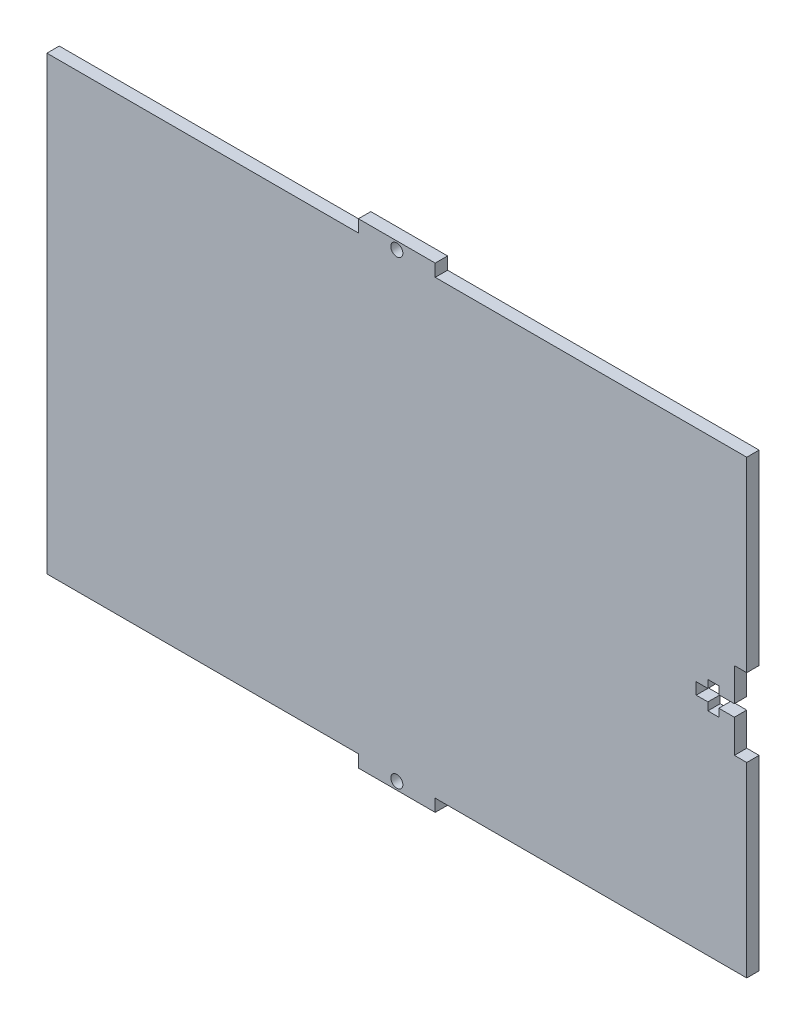
ISO-10303-21;
HEADER;
FILE_DESCRIPTION(('STEP AP214'),'2;1');
FILE_NAME('part.step','',(''),(''),'','','');
FILE_SCHEMA(('AUTOMOTIVE_DESIGN { 1 0 10303 214 1 1 1 1 }'));
ENDSEC;
DATA;
#1=APPLICATION_CONTEXT('core data for automotive mechanical design processes');
#2=APPLICATION_PROTOCOL_DEFINITION('international standard','automotive_design',2000,#1);
#3=PRODUCT_CONTEXT('',#1,'mechanical');
#4=PRODUCT('Part','Part','',(#3));
#5=PRODUCT_RELATED_PRODUCT_CATEGORY('part','',(#4));
#6=PRODUCT_DEFINITION_FORMATION('','',#4);
#7=PRODUCT_DEFINITION_CONTEXT('part definition',#1,'design');
#8=PRODUCT_DEFINITION('design','',#6,#7);
#9=PRODUCT_DEFINITION_SHAPE('','',#8);
#10=(LENGTH_UNIT() NAMED_UNIT(*) SI_UNIT(.MILLI.,.METRE.));
#11=(NAMED_UNIT(*) PLANE_ANGLE_UNIT() SI_UNIT($,.RADIAN.));
#12=(NAMED_UNIT(*) SI_UNIT($,.STERADIAN.) SOLID_ANGLE_UNIT());
#13=UNCERTAINTY_MEASURE_WITH_UNIT(LENGTH_MEASURE(1.E-05),#10,'distance_accuracy_value','');
#14=(GEOMETRIC_REPRESENTATION_CONTEXT(3) GLOBAL_UNCERTAINTY_ASSIGNED_CONTEXT((#13)) GLOBAL_UNIT_ASSIGNED_CONTEXT((#10,
#11,#12)) REPRESENTATION_CONTEXT('',''));
#15=CARTESIAN_POINT('',(0.,0.,0.));
#16=DIRECTION('',(0.,0.,1.));
#17=DIRECTION('',(1.,0.,0.));
#18=AXIS2_PLACEMENT_3D('',#15,#16,#17);
#19=CARTESIAN_POINT('',(-90.,61.18,3.18));
#20=DIRECTION('',(1.,0.,0.));
#21=DIRECTION('',(0.,1.,0.));
#22=AXIS2_PLACEMENT_3D('',#19,#20,#21);
#23=PLANE('',#22);
#24=DIRECTION('',(0.,0.,1.));
#25=VECTOR('',#24,1.);
#26=CARTESIAN_POINT('',(-90.,58.,0.));
#27=LINE('',#26,#25);
#28=CARTESIAN_POINT('',(-90.,58.,0.));
#29=VERTEX_POINT('',#28);
#30=CARTESIAN_POINT('',(-90.,58.,3.18));
#31=VERTEX_POINT('',#30);
#32=EDGE_CURVE('E224',#29,#31,#27,.T.);
#33=ORIENTED_EDGE('',*,*,#32,.F.);
#34=DIRECTION('',(0.,-1.,0.));
#35=VECTOR('',#34,1.);
#36=CARTESIAN_POINT('',(-90.,61.18,0.));
#37=LINE('',#36,#35);
#38=CARTESIAN_POINT('',(-90.,-58.,0.));
#39=VERTEX_POINT('',#38);
#40=EDGE_CURVE('E235',#29,#39,#37,.T.);
#41=ORIENTED_EDGE('',*,*,#40,.T.);
#42=DIRECTION('',(0.,0.,1.));
#43=VECTOR('',#42,1.);
#44=CARTESIAN_POINT('',(-90.,-58.,0.));
#45=LINE('',#44,#43);
#46=CARTESIAN_POINT('',(-90.,-58.,3.18));
#47=VERTEX_POINT('',#46);
#48=EDGE_CURVE('E304',#39,#47,#45,.T.);
#49=ORIENTED_EDGE('',*,*,#48,.T.);
#50=DIRECTION('',(0.,-1.,0.));
#51=VECTOR('',#50,1.);
#52=CARTESIAN_POINT('',(-90.,61.18,3.18));
#53=LINE('',#52,#51);
#54=EDGE_CURVE('E237',#31,#47,#53,.T.);
#55=ORIENTED_EDGE('',*,*,#54,.F.);
#56=EDGE_LOOP('',(#33,#41,#49,#55));
#57=FACE_BOUND('',#56,.T.);
#58=ADVANCED_FACE('F37',(#57),#23,.F.);
#59=CARTESIAN_POINT('',(90.,61.18,3.18));
#60=DIRECTION('',(-1.,0.,0.));
#61=DIRECTION('',(0.,-1.,0.));
#62=AXIS2_PLACEMENT_3D('',#59,#60,#61);
#63=PLANE('',#62);
#64=DIRECTION('',(0.,0.,1.));
#65=VECTOR('',#64,1.);
#66=CARTESIAN_POINT('',(90.,58.,0.));
#67=LINE('',#66,#65);
#68=CARTESIAN_POINT('',(90.,58.,0.));
#69=VERTEX_POINT('',#68);
#70=CARTESIAN_POINT('',(90.,58.,3.18));
#71=VERTEX_POINT('',#70);
#72=EDGE_CURVE('E230',#69,#71,#67,.T.);
#73=ORIENTED_EDGE('',*,*,#72,.T.);
#74=DIRECTION('',(0.,1.,0.));
#75=VECTOR('',#74,1.);
#76=CARTESIAN_POINT('',(90.,61.18,3.18));
#77=LINE('',#76,#75);
#78=CARTESIAN_POINT('',(90.,10.,3.18));
#79=VERTEX_POINT('',#78);
#80=EDGE_CURVE('E448',#79,#71,#77,.T.);
#81=ORIENTED_EDGE('',*,*,#80,.F.);
#82=DIRECTION('',(0.,0.,1.));
#83=VECTOR('',#82,1.);
#84=CARTESIAN_POINT('',(90.,10.,0.));
#85=LINE('',#84,#83);
#86=CARTESIAN_POINT('',(90.,10.,0.));
#87=VERTEX_POINT('',#86);
#88=EDGE_CURVE('E268',#87,#79,#85,.T.);
#89=ORIENTED_EDGE('',*,*,#88,.F.);
#90=DIRECTION('',(0.,1.,0.));
#91=VECTOR('',#90,1.);
#92=CARTESIAN_POINT('',(90.,61.18,0.));
#93=LINE('',#92,#91);
#94=EDGE_CURVE('E247',#87,#69,#93,.T.);
#95=ORIENTED_EDGE('',*,*,#94,.T.);
#96=EDGE_LOOP('',(#73,#81,#89,#95));
#97=FACE_BOUND('',#96,.T.);
#98=ADVANCED_FACE('F265',(#97),#63,.F.);
#99=CARTESIAN_POINT('',(-90.,61.18,3.18));
#100=DIRECTION('',(0.,-1.,0.));
#101=DIRECTION('',(0.,0.,-1.));
#102=AXIS2_PLACEMENT_3D('',#99,#100,#101);
#103=PLANE('',#102);
#104=DIRECTION('',(0.,0.,1.));
#105=VECTOR('',#104,1.);
#106=CARTESIAN_POINT('',(-9.87499999999999,61.18,0.));
#107=LINE('',#106,#105);
#108=CARTESIAN_POINT('',(-9.87499999999999,61.18,0.));
#109=VERTEX_POINT('',#108);
#110=CARTESIAN_POINT('',(-9.87499999999999,61.18,3.18));
#111=VERTEX_POINT('',#110);
#112=EDGE_CURVE('E290',#109,#111,#107,.T.);
#113=ORIENTED_EDGE('',*,*,#112,.T.);
#114=DIRECTION('',(-1.,0.,0.));
#115=VECTOR('',#114,1.);
#116=CARTESIAN_POINT('',(-90.,61.18,3.18));
#117=LINE('',#116,#115);
#118=CARTESIAN_POINT('',(9.87500000000001,61.18,3.18));
#119=VERTEX_POINT('',#118);
#120=EDGE_CURVE('E11',#119,#111,#117,.T.);
#121=ORIENTED_EDGE('',*,*,#120,.F.);
#122=DIRECTION('',(0.,0.,1.));
#123=VECTOR('',#122,1.);
#124=CARTESIAN_POINT('',(9.87500000000001,61.18,0.));
#125=LINE('',#124,#123);
#126=CARTESIAN_POINT('',(9.87500000000001,61.18,0.));
#127=VERTEX_POINT('',#126);
#128=EDGE_CURVE('E278',#127,#119,#125,.T.);
#129=ORIENTED_EDGE('',*,*,#128,.F.);
#130=DIRECTION('',(-1.,0.,0.));
#131=VECTOR('',#130,1.);
#132=CARTESIAN_POINT('',(-90.,61.18,0.));
#133=LINE('',#132,#131);
#134=EDGE_CURVE('E40',#127,#109,#133,.T.);
#135=ORIENTED_EDGE('',*,*,#134,.T.);
#136=EDGE_LOOP('',(#113,#121,#129,#135));
#137=FACE_BOUND('',#136,.T.);
#138=ADVANCED_FACE('F573',(#137),#103,.F.);
#139=CARTESIAN_POINT('',(0.,0.,3.18));
#140=DIRECTION('',(0.,0.,1.));
#141=DIRECTION('',(1.,0.,0.));
#142=AXIS2_PLACEMENT_3D('',#139,#140,#141);
#143=PLANE('',#142);
#144=CARTESIAN_POINT('',(0.,59.18,3.18));
#145=DIRECTION('',(0.,0.,1.));
#146=DIRECTION('',(1.,0.,0.));
#147=AXIS2_PLACEMENT_3D('',#144,#145,#146);
#148=CIRCLE('',#147,1.55);
#149=CARTESIAN_POINT('',(1.55000000000001,59.18,3.18));
#150=VERTEX_POINT('',#149);
#151=EDGE_CURVE('E543',#150,#150,#148,.F.);
#152=ORIENTED_EDGE('',*,*,#151,.T.);
#153=EDGE_LOOP('',(#152));
#154=FACE_BOUND('',#153,.T.);
#155=CARTESIAN_POINT('',(0.,-59.18,3.18));
#156=DIRECTION('',(0.,0.,1.));
#157=DIRECTION('',(1.,0.,0.));
#158=AXIS2_PLACEMENT_3D('',#155,#156,#157);
#159=CIRCLE('',#158,1.55);
#160=CARTESIAN_POINT('',(1.55000000000001,-59.18,3.18));
#161=VERTEX_POINT('',#160);
#162=EDGE_CURVE('E281',#161,#161,#159,.T.);
#163=ORIENTED_EDGE('',*,*,#162,.F.);
#164=EDGE_LOOP('',(#163));
#165=FACE_BOUND('',#164,.T.);
#166=ORIENTED_EDGE('',*,*,#120,.T.);
#167=DIRECTION('',(0.,-1.,0.));
#168=VECTOR('',#167,1.);
#169=CARTESIAN_POINT('',(-9.87499999999999,0.,3.18));
#170=LINE('',#169,#168);
#171=CARTESIAN_POINT('',(-9.87499999999999,58.,3.18));
#172=VERTEX_POINT('',#171);
#173=EDGE_CURVE('E295',#111,#172,#170,.T.);
#174=ORIENTED_EDGE('',*,*,#173,.T.);
#175=DIRECTION('',(-1.,0.,0.));
#176=VECTOR('',#175,1.);
#177=CARTESIAN_POINT('',(0.,58.,3.18));
#178=LINE('',#177,#176);
#179=EDGE_CURVE('E293',#172,#31,#178,.T.);
#180=ORIENTED_EDGE('',*,*,#179,.T.);
#181=ORIENTED_EDGE('',*,*,#54,.T.);
#182=DIRECTION('',(-1.,0.,0.));
#183=VECTOR('',#182,1.);
#184=CARTESIAN_POINT('',(0.,-58.,3.18));
#185=LINE('',#184,#183);
#186=CARTESIAN_POINT('',(-9.87499999999999,-58.,3.18));
#187=VERTEX_POINT('',#186);
#188=EDGE_CURVE('E328',#187,#47,#185,.T.);
#189=ORIENTED_EDGE('',*,*,#188,.F.);
#190=DIRECTION('',(0.,1.,0.));
#191=VECTOR('',#190,1.);
#192=CARTESIAN_POINT('',(-9.87499999999999,0.,3.18));
#193=LINE('',#192,#191);
#194=CARTESIAN_POINT('',(-9.87499999999999,-61.18,3.18));
#195=VERTEX_POINT('',#194);
#196=EDGE_CURVE('E326',#195,#187,#193,.T.);
#197=ORIENTED_EDGE('',*,*,#196,.F.);
#198=DIRECTION('',(1.,0.,0.));
#199=VECTOR('',#198,1.);
#200=CARTESIAN_POINT('',(-90.,-61.18,3.18));
#201=LINE('',#200,#199);
#202=CARTESIAN_POINT('',(9.87500000000001,-61.18,3.18));
#203=VERTEX_POINT('',#202);
#204=EDGE_CURVE('E446',#195,#203,#201,.T.);
#205=ORIENTED_EDGE('',*,*,#204,.T.);
#206=DIRECTION('',(0.,-1.,0.));
#207=VECTOR('',#206,1.);
#208=CARTESIAN_POINT('',(9.87500000000001,0.,3.18));
#209=LINE('',#208,#207);
#210=CARTESIAN_POINT('',(9.87500000000001,-58.,3.18));
#211=VERTEX_POINT('',#210);
#212=EDGE_CURVE('E324',#211,#203,#209,.T.);
#213=ORIENTED_EDGE('',*,*,#212,.F.);
#214=DIRECTION('',(-1.,0.,0.));
#215=VECTOR('',#214,1.);
#216=CARTESIAN_POINT('',(0.,-58.,3.18));
#217=LINE('',#216,#215);
#218=CARTESIAN_POINT('',(90.,-58.,3.18));
#219=VERTEX_POINT('',#218);
#220=EDGE_CURVE('E306',#219,#211,#217,.T.);
#221=ORIENTED_EDGE('',*,*,#220,.F.);
#222=CARTESIAN_POINT('',(90.,-10.,3.18));
#223=VERTEX_POINT('',#222);
#224=EDGE_CURVE('E45',#219,#223,#77,.T.);
#225=ORIENTED_EDGE('',*,*,#224,.T.);
#226=DIRECTION('',(1.,0.,0.));
#227=VECTOR('',#226,1.);
#228=CARTESIAN_POINT('',(0.,-10.,3.18));
#229=LINE('',#228,#227);
#230=CARTESIAN_POINT('',(86.82,-10.,3.18));
#231=VERTEX_POINT('',#230);
#232=EDGE_CURVE('E244',#231,#223,#229,.T.);
#233=ORIENTED_EDGE('',*,*,#232,.F.);
#234=DIRECTION('',(0.,-1.,0.));
#235=VECTOR('',#234,1.);
#236=CARTESIAN_POINT('',(86.82,0.,3.18));
#237=LINE('',#236,#235);
#238=CARTESIAN_POINT('',(86.82,-1.5,3.18));
#239=VERTEX_POINT('',#238);
#240=EDGE_CURVE('E250',#239,#231,#237,.T.);
#241=ORIENTED_EDGE('',*,*,#240,.F.);
#242=DIRECTION('',(1.,0.,0.));
#243=VECTOR('',#242,1.);
#244=CARTESIAN_POINT('',(0.,-1.50000000000001,3.18));
#245=LINE('',#244,#243);
#246=CARTESIAN_POINT('',(82.82,-1.5,3.18));
#247=VERTEX_POINT('',#246);
#248=EDGE_CURVE('E442',#247,#239,#245,.T.);
#249=ORIENTED_EDGE('',*,*,#248,.F.);
#250=DIRECTION('',(0.,1.,0.));
#251=VECTOR('',#250,1.);
#252=CARTESIAN_POINT('',(82.82,0.,3.18));
#253=LINE('',#252,#251);
#254=CARTESIAN_POINT('',(82.82,-3.5,3.18));
#255=VERTEX_POINT('',#254);
#256=EDGE_CURVE('E440',#255,#247,#253,.T.);
#257=ORIENTED_EDGE('',*,*,#256,.F.);
#258=DIRECTION('',(1.,0.,0.));
#259=VECTOR('',#258,1.);
#260=CARTESIAN_POINT('',(0.,-3.5,3.18));
#261=LINE('',#260,#259);
#262=CARTESIAN_POINT('',(80.,-3.5,3.18));
#263=VERTEX_POINT('',#262);
#264=EDGE_CURVE('E438',#263,#255,#261,.T.);
#265=ORIENTED_EDGE('',*,*,#264,.F.);
#266=DIRECTION('',(-1.78329573330416E-12,-1.,0.));
#267=VECTOR('',#266,1.);
#268=CARTESIAN_POINT('',(80.0000000000063,-1.42663658664344E-10,3.18));
#269=LINE('',#268,#267);
#270=CARTESIAN_POINT('',(80.0000000000036,-1.5,3.18));
#271=VERTEX_POINT('',#270);
#272=EDGE_CURVE('E436',#271,#263,#269,.T.);
#273=ORIENTED_EDGE('',*,*,#272,.F.);
#274=DIRECTION('',(1.,0.,0.));
#275=VECTOR('',#274,1.);
#276=CARTESIAN_POINT('',(0.,-1.50000000000001,3.18));
#277=LINE('',#276,#275);
#278=CARTESIAN_POINT('',(77.,-1.5,3.18));
#279=VERTEX_POINT('',#278);
#280=EDGE_CURVE('E434',#279,#271,#277,.T.);
#281=ORIENTED_EDGE('',*,*,#280,.F.);
#282=DIRECTION('',(0.,-1.,0.));
#283=VECTOR('',#282,1.);
#284=CARTESIAN_POINT('',(77.,0.,3.18));
#285=LINE('',#284,#283);
#286=CARTESIAN_POINT('',(77.,1.5,3.18));
#287=VERTEX_POINT('',#286);
#288=EDGE_CURVE('E432',#287,#279,#285,.T.);
#289=ORIENTED_EDGE('',*,*,#288,.F.);
#290=DIRECTION('',(-1.,0.,0.));
#291=VECTOR('',#290,1.);
#292=CARTESIAN_POINT('',(0.,1.49999999999999,3.18));
#293=LINE('',#292,#291);
#294=CARTESIAN_POINT('',(80.,1.5,3.18));
#295=VERTEX_POINT('',#294);
#296=EDGE_CURVE('E430',#295,#287,#293,.T.);
#297=ORIENTED_EDGE('',*,*,#296,.F.);
#298=DIRECTION('',(0.,-1.,0.));
#299=VECTOR('',#298,1.);
#300=CARTESIAN_POINT('',(80.,0.,3.18));
#301=LINE('',#300,#299);
#302=CARTESIAN_POINT('',(80.,3.5,3.18));
#303=VERTEX_POINT('',#302);
#304=EDGE_CURVE('E428',#303,#295,#301,.T.);
#305=ORIENTED_EDGE('',*,*,#304,.F.);
#306=DIRECTION('',(-1.,0.,0.));
#307=VECTOR('',#306,1.);
#308=CARTESIAN_POINT('',(0.,3.5,3.18));
#309=LINE('',#308,#307);
#310=CARTESIAN_POINT('',(82.82,3.5,3.18));
#311=VERTEX_POINT('',#310);
#312=EDGE_CURVE('E426',#311,#303,#309,.T.);
#313=ORIENTED_EDGE('',*,*,#312,.F.);
#314=DIRECTION('',(0.,1.,0.));
#315=VECTOR('',#314,1.);
#316=CARTESIAN_POINT('',(82.82,0.,3.18));
#317=LINE('',#316,#315);
#318=CARTESIAN_POINT('',(82.82,1.5,3.18));
#319=VERTEX_POINT('',#318);
#320=EDGE_CURVE('E424',#319,#311,#317,.T.);
#321=ORIENTED_EDGE('',*,*,#320,.F.);
#322=DIRECTION('',(-1.,0.,0.));
#323=VECTOR('',#322,1.);
#324=CARTESIAN_POINT('',(0.,1.49999999999999,3.18));
#325=LINE('',#324,#323);
#326=CARTESIAN_POINT('',(86.82,1.5,3.18));
#327=VERTEX_POINT('',#326);
#328=EDGE_CURVE('E422',#327,#319,#325,.T.);
#329=ORIENTED_EDGE('',*,*,#328,.F.);
#330=DIRECTION('',(0.,-1.,0.));
#331=VECTOR('',#330,1.);
#332=CARTESIAN_POINT('',(86.82,0.,3.18));
#333=LINE('',#332,#331);
#334=CARTESIAN_POINT('',(86.82,10.,3.18));
#335=VERTEX_POINT('',#334);
#336=EDGE_CURVE('E420',#335,#327,#333,.T.);
#337=ORIENTED_EDGE('',*,*,#336,.F.);
#338=DIRECTION('',(-1.,0.,0.));
#339=VECTOR('',#338,1.);
#340=CARTESIAN_POINT('',(0.,9.9999999999999,3.18));
#341=LINE('',#340,#339);
#342=EDGE_CURVE('E375',#79,#335,#341,.T.);
#343=ORIENTED_EDGE('',*,*,#342,.F.);
#344=ORIENTED_EDGE('',*,*,#80,.T.);
#345=DIRECTION('',(-1.,0.,0.));
#346=VECTOR('',#345,1.);
#347=CARTESIAN_POINT('',(0.,58.,3.18));
#348=LINE('',#347,#346);
#349=CARTESIAN_POINT('',(9.87500000000001,58.,3.18));
#350=VERTEX_POINT('',#349);
#351=EDGE_CURVE('E289',#71,#350,#348,.T.);
#352=ORIENTED_EDGE('',*,*,#351,.T.);
#353=DIRECTION('',(0.,1.,0.));
#354=VECTOR('',#353,1.);
#355=CARTESIAN_POINT('',(9.87500000000001,0.,3.18));
#356=LINE('',#355,#354);
#357=EDGE_CURVE('E286',#350,#119,#356,.T.);
#358=ORIENTED_EDGE('',*,*,#357,.T.);
#359=EDGE_LOOP('',(#166,#174,#180,#181,#189,#197,#205,#213,#221,#225,#233,#241,#249,#257,#265,
#273,#281,#289,#297,#305,#313,#321,#329,#337,#343,#344,#352,#358));
#360=FACE_BOUND('',#359,.T.);
#361=ADVANCED_FACE('F454',(#154,#165,#360),#143,.T.);
#362=CARTESIAN_POINT('',(0.,0.,0.));
#363=DIRECTION('',(0.,0.,1.));
#364=DIRECTION('',(1.,0.,0.));
#365=AXIS2_PLACEMENT_3D('',#362,#363,#364);
#366=PLANE('',#365);
#367=CARTESIAN_POINT('',(0.,59.18,0.));
#368=DIRECTION('',(0.,0.,-1.));
#369=DIRECTION('',(1.,0.,0.));
#370=AXIS2_PLACEMENT_3D('',#367,#368,#369);
#371=CIRCLE('',#370,1.55);
#372=CARTESIAN_POINT('',(1.55000000000001,59.18,0.));
#373=VERTEX_POINT('',#372);
#374=EDGE_CURVE('E546',#373,#373,#371,.T.);
#375=ORIENTED_EDGE('',*,*,#374,.F.);
#376=EDGE_LOOP('',(#375));
#377=FACE_BOUND('',#376,.T.);
#378=CARTESIAN_POINT('',(0.,-59.18,0.));
#379=DIRECTION('',(0.,0.,1.));
#380=DIRECTION('',(1.,0.,0.));
#381=AXIS2_PLACEMENT_3D('',#378,#379,#380);
#382=CIRCLE('',#381,1.55);
#383=CARTESIAN_POINT('',(1.55000000000001,-59.18,0.));
#384=VERTEX_POINT('',#383);
#385=EDGE_CURVE('E540',#384,#384,#382,.T.);
#386=ORIENTED_EDGE('',*,*,#385,.T.);
#387=EDGE_LOOP('',(#386));
#388=FACE_BOUND('',#387,.T.);
#389=DIRECTION('',(0.,-1.,0.));
#390=VECTOR('',#389,1.);
#391=CARTESIAN_POINT('',(-9.87499999999999,61.18,0.));
#392=LINE('',#391,#390);
#393=CARTESIAN_POINT('',(-9.87499999999999,58.,0.));
#394=VERTEX_POINT('',#393);
#395=EDGE_CURVE('E229',#109,#394,#392,.T.);
#396=ORIENTED_EDGE('',*,*,#395,.F.);
#397=ORIENTED_EDGE('',*,*,#134,.F.);
#398=DIRECTION('',(0.,1.,0.));
#399=VECTOR('',#398,1.);
#400=CARTESIAN_POINT('',(9.87500000000001,61.18,0.));
#401=LINE('',#400,#399);
#402=CARTESIAN_POINT('',(9.87500000000001,58.,0.));
#403=VERTEX_POINT('',#402);
#404=EDGE_CURVE('E276',#403,#127,#401,.T.);
#405=ORIENTED_EDGE('',*,*,#404,.F.);
#406=DIRECTION('',(-1.,0.,0.));
#407=VECTOR('',#406,1.);
#408=CARTESIAN_POINT('',(90.,58.,0.));
#409=LINE('',#408,#407);
#410=EDGE_CURVE('E274',#69,#403,#409,.T.);
#411=ORIENTED_EDGE('',*,*,#410,.F.);
#412=ORIENTED_EDGE('',*,*,#94,.F.);
#413=DIRECTION('',(-1.,0.,0.));
#414=VECTOR('',#413,1.);
#415=CARTESIAN_POINT('',(90.,10.,0.));
#416=LINE('',#415,#414);
#417=CARTESIAN_POINT('',(86.82,10.,0.));
#418=VERTEX_POINT('',#417);
#419=EDGE_CURVE('E272',#87,#418,#416,.T.);
#420=ORIENTED_EDGE('',*,*,#419,.T.);
#421=DIRECTION('',(0.,-1.,0.));
#422=VECTOR('',#421,1.);
#423=CARTESIAN_POINT('',(86.82,10.,0.));
#424=LINE('',#423,#422);
#425=CARTESIAN_POINT('',(86.82,1.5,0.));
#426=VERTEX_POINT('',#425);
#427=EDGE_CURVE('E332',#418,#426,#424,.T.);
#428=ORIENTED_EDGE('',*,*,#427,.T.);
#429=DIRECTION('',(-1.,0.,0.));
#430=VECTOR('',#429,1.);
#431=CARTESIAN_POINT('',(86.82,1.5,0.));
#432=LINE('',#431,#430);
#433=CARTESIAN_POINT('',(82.82,1.5,0.));
#434=VERTEX_POINT('',#433);
#435=EDGE_CURVE('E334',#426,#434,#432,.T.);
#436=ORIENTED_EDGE('',*,*,#435,.T.);
#437=DIRECTION('',(0.,1.,0.));
#438=VECTOR('',#437,1.);
#439=CARTESIAN_POINT('',(82.82,3.5,0.));
#440=LINE('',#439,#438);
#441=CARTESIAN_POINT('',(82.82,3.5,0.));
#442=VERTEX_POINT('',#441);
#443=EDGE_CURVE('E337',#434,#442,#440,.T.);
#444=ORIENTED_EDGE('',*,*,#443,.T.);
#445=DIRECTION('',(-1.,0.,0.));
#446=VECTOR('',#445,1.);
#447=CARTESIAN_POINT('',(80.,3.5,0.));
#448=LINE('',#447,#446);
#449=CARTESIAN_POINT('',(80.,3.5,0.));
#450=VERTEX_POINT('',#449);
#451=EDGE_CURVE('E340',#442,#450,#448,.T.);
#452=ORIENTED_EDGE('',*,*,#451,.T.);
#453=DIRECTION('',(0.,-1.,0.));
#454=VECTOR('',#453,1.);
#455=CARTESIAN_POINT('',(80.,3.5,0.));
#456=LINE('',#455,#454);
#457=CARTESIAN_POINT('',(80.,1.5,0.));
#458=VERTEX_POINT('',#457);
#459=EDGE_CURVE('E343',#450,#458,#456,.T.);
#460=ORIENTED_EDGE('',*,*,#459,.T.);
#461=DIRECTION('',(-1.,0.,0.));
#462=VECTOR('',#461,1.);
#463=CARTESIAN_POINT('',(80.,1.5,0.));
#464=LINE('',#463,#462);
#465=CARTESIAN_POINT('',(77.,1.5,0.));
#466=VERTEX_POINT('',#465);
#467=EDGE_CURVE('E346',#458,#466,#464,.T.);
#468=ORIENTED_EDGE('',*,*,#467,.T.);
#469=DIRECTION('',(0.,-1.,0.));
#470=VECTOR('',#469,1.);
#471=CARTESIAN_POINT('',(77.,1.5,0.));
#472=LINE('',#471,#470);
#473=CARTESIAN_POINT('',(77.,-1.5,0.));
#474=VERTEX_POINT('',#473);
#475=EDGE_CURVE('E349',#466,#474,#472,.T.);
#476=ORIENTED_EDGE('',*,*,#475,.T.);
#477=DIRECTION('',(1.,0.,0.));
#478=VECTOR('',#477,1.);
#479=CARTESIAN_POINT('',(80.0000000000036,-1.5,0.));
#480=LINE('',#479,#478);
#481=CARTESIAN_POINT('',(80.0000000000036,-1.5,0.));
#482=VERTEX_POINT('',#481);
#483=EDGE_CURVE('E352',#474,#482,#480,.T.);
#484=ORIENTED_EDGE('',*,*,#483,.T.);
#485=DIRECTION('',(-1.78329573330416E-12,-1.,0.));
#486=VECTOR('',#485,1.);
#487=CARTESIAN_POINT('',(80.0000000000036,-1.5,0.));
#488=LINE('',#487,#486);
#489=CARTESIAN_POINT('',(80.,-3.5,0.));
#490=VERTEX_POINT('',#489);
#491=EDGE_CURVE('E355',#482,#490,#488,.T.);
#492=ORIENTED_EDGE('',*,*,#491,.T.);
#493=DIRECTION('',(1.,0.,0.));
#494=VECTOR('',#493,1.);
#495=CARTESIAN_POINT('',(80.,-3.5,0.));
#496=LINE('',#495,#494);
#497=CARTESIAN_POINT('',(82.82,-3.5,0.));
#498=VERTEX_POINT('',#497);
#499=EDGE_CURVE('E358',#490,#498,#496,.T.);
#500=ORIENTED_EDGE('',*,*,#499,.T.);
#501=DIRECTION('',(0.,1.,0.));
#502=VECTOR('',#501,1.);
#503=CARTESIAN_POINT('',(82.82,-1.5,0.));
#504=LINE('',#503,#502);
#505=CARTESIAN_POINT('',(82.82,-1.5,0.));
#506=VERTEX_POINT('',#505);
#507=EDGE_CURVE('E361',#498,#506,#504,.T.);
#508=ORIENTED_EDGE('',*,*,#507,.T.);
#509=DIRECTION('',(1.,0.,0.));
#510=VECTOR('',#509,1.);
#511=CARTESIAN_POINT('',(86.82,-1.5,0.));
#512=LINE('',#511,#510);
#513=CARTESIAN_POINT('',(86.82,-1.5,0.));
#514=VERTEX_POINT('',#513);
#515=EDGE_CURVE('E364',#506,#514,#512,.T.);
#516=ORIENTED_EDGE('',*,*,#515,.T.);
#517=DIRECTION('',(0.,-1.,0.));
#518=VECTOR('',#517,1.);
#519=CARTESIAN_POINT('',(86.82,-1.5,0.));
#520=LINE('',#519,#518);
#521=CARTESIAN_POINT('',(86.82,-10.,0.));
#522=VERTEX_POINT('',#521);
#523=EDGE_CURVE('E367',#514,#522,#520,.T.);
#524=ORIENTED_EDGE('',*,*,#523,.T.);
#525=DIRECTION('',(1.,0.,0.));
#526=VECTOR('',#525,1.);
#527=CARTESIAN_POINT('',(90.,-10.,0.));
#528=LINE('',#527,#526);
#529=CARTESIAN_POINT('',(90.,-10.,0.));
#530=VERTEX_POINT('',#529);
#531=EDGE_CURVE('E370',#522,#530,#528,.T.);
#532=ORIENTED_EDGE('',*,*,#531,.T.);
#533=CARTESIAN_POINT('',(90.,-58.,0.));
#534=VERTEX_POINT('',#533);
#535=EDGE_CURVE('E253',#534,#530,#93,.T.);
#536=ORIENTED_EDGE('',*,*,#535,.F.);
#537=DIRECTION('',(-1.,0.,0.));
#538=VECTOR('',#537,1.);
#539=CARTESIAN_POINT('',(90.,-58.,0.));
#540=LINE('',#539,#538);
#541=CARTESIAN_POINT('',(9.87500000000001,-58.,0.));
#542=VERTEX_POINT('',#541);
#543=EDGE_CURVE('E298',#534,#542,#540,.T.);
#544=ORIENTED_EDGE('',*,*,#543,.T.);
#545=DIRECTION('',(0.,-1.,0.));
#546=VECTOR('',#545,1.);
#547=CARTESIAN_POINT('',(9.87500000000001,-61.18,0.));
#548=LINE('',#547,#546);
#549=CARTESIAN_POINT('',(9.87500000000001,-61.18,0.));
#550=VERTEX_POINT('',#549);
#551=EDGE_CURVE('E313',#542,#550,#548,.T.);
#552=ORIENTED_EDGE('',*,*,#551,.T.);
#553=DIRECTION('',(1.,0.,0.));
#554=VECTOR('',#553,1.);
#555=CARTESIAN_POINT('',(-90.,-61.18,0.));
#556=LINE('',#555,#554);
#557=CARTESIAN_POINT('',(-9.87499999999999,-61.18,0.));
#558=VERTEX_POINT('',#557);
#559=EDGE_CURVE('E243',#558,#550,#556,.T.);
#560=ORIENTED_EDGE('',*,*,#559,.F.);
#561=DIRECTION('',(0.,1.,0.));
#562=VECTOR('',#561,1.);
#563=CARTESIAN_POINT('',(-9.87499999999999,-61.18,0.));
#564=LINE('',#563,#562);
#565=CARTESIAN_POINT('',(-9.87499999999999,-58.,0.));
#566=VERTEX_POINT('',#565);
#567=EDGE_CURVE('E299',#558,#566,#564,.T.);
#568=ORIENTED_EDGE('',*,*,#567,.T.);
#569=DIRECTION('',(-1.,0.,0.));
#570=VECTOR('',#569,1.);
#571=CARTESIAN_POINT('',(-90.,-58.,0.));
#572=LINE('',#571,#570);
#573=EDGE_CURVE('E242',#566,#39,#572,.T.);
#574=ORIENTED_EDGE('',*,*,#573,.T.);
#575=ORIENTED_EDGE('',*,*,#40,.F.);
#576=DIRECTION('',(-1.,0.,0.));
#577=VECTOR('',#576,1.);
#578=CARTESIAN_POINT('',(-90.,58.,0.));
#579=LINE('',#578,#577);
#580=EDGE_CURVE('E221',#394,#29,#579,.T.);
#581=ORIENTED_EDGE('',*,*,#580,.F.);
#582=EDGE_LOOP('',(#396,#397,#405,#411,#412,#420,#428,#436,#444,#452,#460,#468,#476,#484,#492,
#500,#508,#516,#524,#532,#536,#544,#552,#560,#568,#574,#575,#581));
#583=FACE_BOUND('',#582,.T.);
#584=ADVANCED_FACE('F240',(#377,#388,#583),#366,.F.);
#585=ORIENTED_EDGE('',*,*,#224,.F.);
#586=DIRECTION('',(0.,0.,1.));
#587=VECTOR('',#586,1.);
#588=CARTESIAN_POINT('',(90.,-58.,0.));
#589=LINE('',#588,#587);
#590=EDGE_CURVE('E316',#534,#219,#589,.T.);
#591=ORIENTED_EDGE('',*,*,#590,.F.);
#592=ORIENTED_EDGE('',*,*,#535,.T.);
#593=DIRECTION('',(0.,0.,1.));
#594=VECTOR('',#593,1.);
#595=CARTESIAN_POINT('',(90.,-10.,0.));
#596=LINE('',#595,#594);
#597=EDGE_CURVE('E373',#530,#223,#596,.T.);
#598=ORIENTED_EDGE('',*,*,#597,.T.);
#599=EDGE_LOOP('',(#585,#591,#592,#598));
#600=FACE_BOUND('',#599,.T.);
#601=ADVANCED_FACE('F512',(#600),#63,.F.);
#602=CARTESIAN_POINT('',(-90.,-61.18,3.18));
#603=DIRECTION('',(0.,1.,0.));
#604=DIRECTION('',(0.,0.,1.));
#605=AXIS2_PLACEMENT_3D('',#602,#603,#604);
#606=PLANE('',#605);
#607=ORIENTED_EDGE('',*,*,#204,.F.);
#608=DIRECTION('',(0.,0.,1.));
#609=VECTOR('',#608,1.);
#610=CARTESIAN_POINT('',(-9.87499999999999,-61.18,0.));
#611=LINE('',#610,#609);
#612=EDGE_CURVE('E303',#558,#195,#611,.T.);
#613=ORIENTED_EDGE('',*,*,#612,.F.);
#614=ORIENTED_EDGE('',*,*,#559,.T.);
#615=DIRECTION('',(0.,0.,1.));
#616=VECTOR('',#615,1.);
#617=CARTESIAN_POINT('',(9.87500000000001,-61.18,0.));
#618=LINE('',#617,#616);
#619=EDGE_CURVE('E301',#550,#203,#618,.T.);
#620=ORIENTED_EDGE('',*,*,#619,.T.);
#621=EDGE_LOOP('',(#607,#613,#614,#620));
#622=FACE_BOUND('',#621,.T.);
#623=ADVANCED_FACE('F522',(#622),#606,.F.);
#624=CARTESIAN_POINT('',(90.,-10.,0.));
#625=DIRECTION('',(0.,-1.,0.));
#626=DIRECTION('',(0.,0.,-1.));
#627=AXIS2_PLACEMENT_3D('',#624,#625,#626);
#628=PLANE('',#627);
#629=ORIENTED_EDGE('',*,*,#232,.T.);
#630=ORIENTED_EDGE('',*,*,#597,.F.);
#631=ORIENTED_EDGE('',*,*,#531,.F.);
#632=DIRECTION('',(0.,0.,1.));
#633=VECTOR('',#632,1.);
#634=CARTESIAN_POINT('',(86.82,-10.,0.));
#635=LINE('',#634,#633);
#636=EDGE_CURVE('E376',#522,#231,#635,.T.);
#637=ORIENTED_EDGE('',*,*,#636,.T.);
#638=EDGE_LOOP('',(#629,#630,#631,#637));
#639=FACE_BOUND('',#638,.T.);
#640=ADVANCED_FACE('F511',(#639),#628,.F.);
#641=CARTESIAN_POINT('',(86.82,-1.5,0.));
#642=DIRECTION('',(-1.,0.,0.));
#643=DIRECTION('',(0.,0.,1.));
#644=AXIS2_PLACEMENT_3D('',#641,#642,#643);
#645=PLANE('',#644);
#646=ORIENTED_EDGE('',*,*,#240,.T.);
#647=ORIENTED_EDGE('',*,*,#636,.F.);
#648=ORIENTED_EDGE('',*,*,#523,.F.);
#649=DIRECTION('',(0.,0.,1.));
#650=VECTOR('',#649,1.);
#651=CARTESIAN_POINT('',(86.82,-1.5,0.));
#652=LINE('',#651,#650);
#653=EDGE_CURVE('E379',#514,#239,#652,.T.);
#654=ORIENTED_EDGE('',*,*,#653,.T.);
#655=EDGE_LOOP('',(#646,#647,#648,#654));
#656=FACE_BOUND('',#655,.T.);
#657=ADVANCED_FACE('F508',(#656),#645,.F.);
#658=CARTESIAN_POINT('',(86.82,-1.5,0.));
#659=DIRECTION('',(0.,-1.,0.));
#660=DIRECTION('',(1.,0.,0.));
#661=AXIS2_PLACEMENT_3D('',#658,#659,#660);
#662=PLANE('',#661);
#663=ORIENTED_EDGE('',*,*,#248,.T.);
#664=ORIENTED_EDGE('',*,*,#653,.F.);
#665=ORIENTED_EDGE('',*,*,#515,.F.);
#666=DIRECTION('',(0.,0.,1.));
#667=VECTOR('',#666,1.);
#668=CARTESIAN_POINT('',(82.82,-1.5,0.));
#669=LINE('',#668,#667);
#670=EDGE_CURVE('E382',#506,#247,#669,.T.);
#671=ORIENTED_EDGE('',*,*,#670,.T.);
#672=EDGE_LOOP('',(#663,#664,#665,#671));
#673=FACE_BOUND('',#672,.T.);
#674=ADVANCED_FACE('F504',(#673),#662,.F.);
#675=CARTESIAN_POINT('',(82.82,-1.5,0.));
#676=DIRECTION('',(1.,0.,0.));
#677=DIRECTION('',(0.,0.,-1.));
#678=AXIS2_PLACEMENT_3D('',#675,#676,#677);
#679=PLANE('',#678);
#680=ORIENTED_EDGE('',*,*,#256,.T.);
#681=ORIENTED_EDGE('',*,*,#670,.F.);
#682=ORIENTED_EDGE('',*,*,#507,.F.);
#683=DIRECTION('',(0.,0.,1.));
#684=VECTOR('',#683,1.);
#685=CARTESIAN_POINT('',(82.82,-3.5,0.));
#686=LINE('',#685,#684);
#687=EDGE_CURVE('E385',#498,#255,#686,.T.);
#688=ORIENTED_EDGE('',*,*,#687,.T.);
#689=EDGE_LOOP('',(#680,#681,#682,#688));
#690=FACE_BOUND('',#689,.T.);
#691=ADVANCED_FACE('F500',(#690),#679,.F.);
#692=CARTESIAN_POINT('',(80.,-3.5,0.));
#693=DIRECTION('',(0.,-1.,0.));
#694=DIRECTION('',(0.,0.,-1.));
#695=AXIS2_PLACEMENT_3D('',#692,#693,#694);
#696=PLANE('',#695);
#697=ORIENTED_EDGE('',*,*,#264,.T.);
#698=ORIENTED_EDGE('',*,*,#687,.F.);
#699=ORIENTED_EDGE('',*,*,#499,.F.);
#700=DIRECTION('',(0.,0.,1.));
#701=VECTOR('',#700,1.);
#702=CARTESIAN_POINT('',(80.,-3.5,0.));
#703=LINE('',#702,#701);
#704=EDGE_CURVE('E388',#490,#263,#703,.T.);
#705=ORIENTED_EDGE('',*,*,#704,.T.);
#706=EDGE_LOOP('',(#697,#698,#699,#705));
#707=FACE_BOUND('',#706,.T.);
#708=ADVANCED_FACE('F496',(#707),#696,.F.);
#709=CARTESIAN_POINT('',(80.0000000000036,-1.5,0.));
#710=DIRECTION('',(-1.,1.78329573330416E-12,0.));
#711=DIRECTION('',(-1.78329573330416E-12,-1.,0.));
#712=AXIS2_PLACEMENT_3D('',#709,#710,#711);
#713=PLANE('',#712);
#714=ORIENTED_EDGE('',*,*,#272,.T.);
#715=ORIENTED_EDGE('',*,*,#704,.F.);
#716=ORIENTED_EDGE('',*,*,#491,.F.);
#717=DIRECTION('',(0.,0.,1.));
#718=VECTOR('',#717,1.);
#719=CARTESIAN_POINT('',(80.0000000000036,-1.5,0.));
#720=LINE('',#719,#718);
#721=EDGE_CURVE('E391',#482,#271,#720,.T.);
#722=ORIENTED_EDGE('',*,*,#721,.T.);
#723=EDGE_LOOP('',(#714,#715,#716,#722));
#724=FACE_BOUND('',#723,.T.);
#725=ADVANCED_FACE('F492',(#724),#713,.F.);
#726=CARTESIAN_POINT('',(80.0000000000036,-1.5,0.));
#727=DIRECTION('',(0.,-1.,0.));
#728=DIRECTION('',(1.,0.,0.));
#729=AXIS2_PLACEMENT_3D('',#726,#727,#728);
#730=PLANE('',#729);
#731=ORIENTED_EDGE('',*,*,#280,.T.);
#732=ORIENTED_EDGE('',*,*,#721,.F.);
#733=ORIENTED_EDGE('',*,*,#483,.F.);
#734=DIRECTION('',(0.,0.,1.));
#735=VECTOR('',#734,1.);
#736=CARTESIAN_POINT('',(77.,-1.5,0.));
#737=LINE('',#736,#735);
#738=EDGE_CURVE('E394',#474,#279,#737,.T.);
#739=ORIENTED_EDGE('',*,*,#738,.T.);
#740=EDGE_LOOP('',(#731,#732,#733,#739));
#741=FACE_BOUND('',#740,.T.);
#742=ADVANCED_FACE('F488',(#741),#730,.F.);
#743=CARTESIAN_POINT('',(77.,1.5,0.));
#744=DIRECTION('',(-1.,0.,0.));
#745=DIRECTION('',(0.,0.,1.));
#746=AXIS2_PLACEMENT_3D('',#743,#744,#745);
#747=PLANE('',#746);
#748=ORIENTED_EDGE('',*,*,#288,.T.);
#749=ORIENTED_EDGE('',*,*,#738,.F.);
#750=ORIENTED_EDGE('',*,*,#475,.F.);
#751=DIRECTION('',(0.,0.,1.));
#752=VECTOR('',#751,1.);
#753=CARTESIAN_POINT('',(77.,1.5,0.));
#754=LINE('',#753,#752);
#755=EDGE_CURVE('E397',#466,#287,#754,.T.);
#756=ORIENTED_EDGE('',*,*,#755,.T.);
#757=EDGE_LOOP('',(#748,#749,#750,#756));
#758=FACE_BOUND('',#757,.T.);
#759=ADVANCED_FACE('F484',(#758),#747,.F.);
#760=CARTESIAN_POINT('',(80.,1.5,0.));
#761=DIRECTION('',(0.,1.,0.));
#762=DIRECTION('',(-1.,0.,0.));
#763=AXIS2_PLACEMENT_3D('',#760,#761,#762);
#764=PLANE('',#763);
#765=ORIENTED_EDGE('',*,*,#296,.T.);
#766=ORIENTED_EDGE('',*,*,#755,.F.);
#767=ORIENTED_EDGE('',*,*,#467,.F.);
#768=DIRECTION('',(0.,0.,1.));
#769=VECTOR('',#768,1.);
#770=CARTESIAN_POINT('',(80.,1.5,0.));
#771=LINE('',#770,#769);
#772=EDGE_CURVE('E400',#458,#295,#771,.T.);
#773=ORIENTED_EDGE('',*,*,#772,.T.);
#774=EDGE_LOOP('',(#765,#766,#767,#773));
#775=FACE_BOUND('',#774,.T.);
#776=ADVANCED_FACE('F480',(#775),#764,.F.);
#777=CARTESIAN_POINT('',(80.,3.5,0.));
#778=DIRECTION('',(-1.,0.,0.));
#779=DIRECTION('',(0.,0.,1.));
#780=AXIS2_PLACEMENT_3D('',#777,#778,#779);
#781=PLANE('',#780);
#782=ORIENTED_EDGE('',*,*,#304,.T.);
#783=ORIENTED_EDGE('',*,*,#772,.F.);
#784=ORIENTED_EDGE('',*,*,#459,.F.);
#785=DIRECTION('',(0.,0.,1.));
#786=VECTOR('',#785,1.);
#787=CARTESIAN_POINT('',(80.,3.5,0.));
#788=LINE('',#787,#786);
#789=EDGE_CURVE('E403',#450,#303,#788,.T.);
#790=ORIENTED_EDGE('',*,*,#789,.T.);
#791=EDGE_LOOP('',(#782,#783,#784,#790));
#792=FACE_BOUND('',#791,.T.);
#793=ADVANCED_FACE('F476',(#792),#781,.F.);
#794=CARTESIAN_POINT('',(80.,3.5,0.));
#795=DIRECTION('',(0.,1.,0.));
#796=DIRECTION('',(0.,0.,1.));
#797=AXIS2_PLACEMENT_3D('',#794,#795,#796);
#798=PLANE('',#797);
#799=ORIENTED_EDGE('',*,*,#312,.T.);
#800=ORIENTED_EDGE('',*,*,#789,.F.);
#801=ORIENTED_EDGE('',*,*,#451,.F.);
#802=DIRECTION('',(0.,0.,1.));
#803=VECTOR('',#802,1.);
#804=CARTESIAN_POINT('',(82.82,3.5,0.));
#805=LINE('',#804,#803);
#806=EDGE_CURVE('E406',#442,#311,#805,.T.);
#807=ORIENTED_EDGE('',*,*,#806,.T.);
#808=EDGE_LOOP('',(#799,#800,#801,#807));
#809=FACE_BOUND('',#808,.T.);
#810=ADVANCED_FACE('F472',(#809),#798,.F.);
#811=CARTESIAN_POINT('',(82.82,3.5,0.));
#812=DIRECTION('',(1.,0.,0.));
#813=DIRECTION('',(0.,0.,-1.));
#814=AXIS2_PLACEMENT_3D('',#811,#812,#813);
#815=PLANE('',#814);
#816=ORIENTED_EDGE('',*,*,#320,.T.);
#817=ORIENTED_EDGE('',*,*,#806,.F.);
#818=ORIENTED_EDGE('',*,*,#443,.F.);
#819=DIRECTION('',(0.,0.,1.));
#820=VECTOR('',#819,1.);
#821=CARTESIAN_POINT('',(82.82,1.5,0.));
#822=LINE('',#821,#820);
#823=EDGE_CURVE('E409',#434,#319,#822,.T.);
#824=ORIENTED_EDGE('',*,*,#823,.T.);
#825=EDGE_LOOP('',(#816,#817,#818,#824));
#826=FACE_BOUND('',#825,.T.);
#827=ADVANCED_FACE('F468',(#826),#815,.F.);
#828=CARTESIAN_POINT('',(86.82,1.5,0.));
#829=DIRECTION('',(0.,1.,0.));
#830=DIRECTION('',(-1.,0.,0.));
#831=AXIS2_PLACEMENT_3D('',#828,#829,#830);
#832=PLANE('',#831);
#833=ORIENTED_EDGE('',*,*,#328,.T.);
#834=ORIENTED_EDGE('',*,*,#823,.F.);
#835=ORIENTED_EDGE('',*,*,#435,.F.);
#836=DIRECTION('',(0.,0.,1.));
#837=VECTOR('',#836,1.);
#838=CARTESIAN_POINT('',(86.82,1.5,0.));
#839=LINE('',#838,#837);
#840=EDGE_CURVE('E412',#426,#327,#839,.T.);
#841=ORIENTED_EDGE('',*,*,#840,.T.);
#842=EDGE_LOOP('',(#833,#834,#835,#841));
#843=FACE_BOUND('',#842,.T.);
#844=ADVANCED_FACE('F465',(#843),#832,.F.);
#845=CARTESIAN_POINT('',(86.82,10.,0.));
#846=DIRECTION('',(-1.,0.,0.));
#847=DIRECTION('',(0.,0.,1.));
#848=AXIS2_PLACEMENT_3D('',#845,#846,#847);
#849=PLANE('',#848);
#850=ORIENTED_EDGE('',*,*,#336,.T.);
#851=ORIENTED_EDGE('',*,*,#840,.F.);
#852=ORIENTED_EDGE('',*,*,#427,.F.);
#853=DIRECTION('',(0.,0.,1.));
#854=VECTOR('',#853,1.);
#855=CARTESIAN_POINT('',(86.82,10.,0.));
#856=LINE('',#855,#854);
#857=EDGE_CURVE('E415',#418,#335,#856,.T.);
#858=ORIENTED_EDGE('',*,*,#857,.T.);
#859=EDGE_LOOP('',(#850,#851,#852,#858));
#860=FACE_BOUND('',#859,.T.);
#861=ADVANCED_FACE('F461',(#860),#849,.F.);
#862=CARTESIAN_POINT('',(90.,10.,0.));
#863=DIRECTION('',(0.,1.,0.));
#864=DIRECTION('',(-1.,0.,0.));
#865=AXIS2_PLACEMENT_3D('',#862,#863,#864);
#866=PLANE('',#865);
#867=ORIENTED_EDGE('',*,*,#342,.T.);
#868=ORIENTED_EDGE('',*,*,#857,.F.);
#869=ORIENTED_EDGE('',*,*,#419,.F.);
#870=ORIENTED_EDGE('',*,*,#88,.T.);
#871=EDGE_LOOP('',(#867,#868,#869,#870));
#872=FACE_BOUND('',#871,.T.);
#873=ADVANCED_FACE('F459',(#872),#866,.F.);
#874=CARTESIAN_POINT('',(9.87500000000001,-61.18,0.));
#875=DIRECTION('',(-1.,0.,0.));
#876=DIRECTION('',(0.,0.,1.));
#877=AXIS2_PLACEMENT_3D('',#874,#875,#876);
#878=PLANE('',#877);
#879=ORIENTED_EDGE('',*,*,#212,.T.);
#880=ORIENTED_EDGE('',*,*,#619,.F.);
#881=ORIENTED_EDGE('',*,*,#551,.F.);
#882=DIRECTION('',(0.,0.,1.));
#883=VECTOR('',#882,1.);
#884=CARTESIAN_POINT('',(9.87500000000001,-58.,0.));
#885=LINE('',#884,#883);
#886=EDGE_CURVE('E319',#542,#211,#885,.T.);
#887=ORIENTED_EDGE('',*,*,#886,.T.);
#888=EDGE_LOOP('',(#879,#880,#881,#887));
#889=FACE_BOUND('',#888,.T.);
#890=ADVANCED_FACE('F520',(#889),#878,.F.);
#891=CARTESIAN_POINT('',(90.,-58.,0.));
#892=DIRECTION('',(0.,1.,0.));
#893=DIRECTION('',(0.,0.,1.));
#894=AXIS2_PLACEMENT_3D('',#891,#892,#893);
#895=PLANE('',#894);
#896=ORIENTED_EDGE('',*,*,#220,.T.);
#897=ORIENTED_EDGE('',*,*,#886,.F.);
#898=ORIENTED_EDGE('',*,*,#543,.F.);
#899=ORIENTED_EDGE('',*,*,#590,.T.);
#900=EDGE_LOOP('',(#896,#897,#898,#899));
#901=FACE_BOUND('',#900,.T.);
#902=ADVANCED_FACE('F514',(#901),#895,.F.);
#903=CARTESIAN_POINT('',(-90.,-58.,0.));
#904=DIRECTION('',(0.,1.,0.));
#905=DIRECTION('',(0.,0.,1.));
#906=AXIS2_PLACEMENT_3D('',#903,#904,#905);
#907=PLANE('',#906);
#908=ORIENTED_EDGE('',*,*,#188,.T.);
#909=ORIENTED_EDGE('',*,*,#48,.F.);
#910=ORIENTED_EDGE('',*,*,#573,.F.);
#911=DIRECTION('',(0.,0.,1.));
#912=VECTOR('',#911,1.);
#913=CARTESIAN_POINT('',(-9.87499999999999,-58.,0.));
#914=LINE('',#913,#912);
#915=EDGE_CURVE('E307',#566,#187,#914,.T.);
#916=ORIENTED_EDGE('',*,*,#915,.T.);
#917=EDGE_LOOP('',(#908,#909,#910,#916));
#918=FACE_BOUND('',#917,.T.);
#919=ADVANCED_FACE('F530',(#918),#907,.F.);
#920=CARTESIAN_POINT('',(-9.87499999999999,-61.18,0.));
#921=DIRECTION('',(1.,0.,0.));
#922=DIRECTION('',(0.,0.,-1.));
#923=AXIS2_PLACEMENT_3D('',#920,#921,#922);
#924=PLANE('',#923);
#925=ORIENTED_EDGE('',*,*,#196,.T.);
#926=ORIENTED_EDGE('',*,*,#915,.F.);
#927=ORIENTED_EDGE('',*,*,#567,.F.);
#928=ORIENTED_EDGE('',*,*,#612,.T.);
#929=EDGE_LOOP('',(#925,#926,#927,#928));
#930=FACE_BOUND('',#929,.T.);
#931=ADVANCED_FACE('F527',(#930),#924,.F.);
#932=CARTESIAN_POINT('',(90.,58.,0.));
#933=DIRECTION('',(0.,1.,0.));
#934=DIRECTION('',(0.,0.,1.));
#935=AXIS2_PLACEMENT_3D('',#932,#933,#934);
#936=PLANE('',#935);
#937=ORIENTED_EDGE('',*,*,#72,.F.);
#938=ORIENTED_EDGE('',*,*,#410,.T.);
#939=DIRECTION('',(0.,0.,1.));
#940=VECTOR('',#939,1.);
#941=CARTESIAN_POINT('',(9.87500000000001,58.,0.));
#942=LINE('',#941,#940);
#943=EDGE_CURVE('E61',#403,#350,#942,.T.);
#944=ORIENTED_EDGE('',*,*,#943,.T.);
#945=ORIENTED_EDGE('',*,*,#351,.F.);
#946=EDGE_LOOP('',(#937,#938,#944,#945));
#947=FACE_BOUND('',#946,.T.);
#948=ADVANCED_FACE('F667',(#947),#936,.T.);
#949=CARTESIAN_POINT('',(9.87500000000001,61.18,0.));
#950=DIRECTION('',(1.,0.,0.));
#951=DIRECTION('',(0.,0.,-1.));
#952=AXIS2_PLACEMENT_3D('',#949,#950,#951);
#953=PLANE('',#952);
#954=ORIENTED_EDGE('',*,*,#943,.F.);
#955=ORIENTED_EDGE('',*,*,#404,.T.);
#956=ORIENTED_EDGE('',*,*,#128,.T.);
#957=ORIENTED_EDGE('',*,*,#357,.F.);
#958=EDGE_LOOP('',(#954,#955,#956,#957));
#959=FACE_BOUND('',#958,.T.);
#960=ADVANCED_FACE('F660',(#959),#953,.T.);
#961=CARTESIAN_POINT('',(-9.87499999999999,61.18,0.));
#962=DIRECTION('',(-1.,0.,0.));
#963=DIRECTION('',(0.,0.,1.));
#964=AXIS2_PLACEMENT_3D('',#961,#962,#963);
#965=PLANE('',#964);
#966=ORIENTED_EDGE('',*,*,#112,.F.);
#967=ORIENTED_EDGE('',*,*,#395,.T.);
#968=DIRECTION('',(0.,0.,1.));
#969=VECTOR('',#968,1.);
#970=CARTESIAN_POINT('',(-9.87499999999999,58.,0.));
#971=LINE('',#970,#969);
#972=EDGE_CURVE('E53',#394,#172,#971,.T.);
#973=ORIENTED_EDGE('',*,*,#972,.T.);
#974=ORIENTED_EDGE('',*,*,#173,.F.);
#975=EDGE_LOOP('',(#966,#967,#973,#974));
#976=FACE_BOUND('',#975,.T.);
#977=ADVANCED_FACE('F532',(#976),#965,.T.);
#978=CARTESIAN_POINT('',(-90.,58.,0.));
#979=DIRECTION('',(0.,1.,0.));
#980=DIRECTION('',(0.,0.,1.));
#981=AXIS2_PLACEMENT_3D('',#978,#979,#980);
#982=PLANE('',#981);
#983=ORIENTED_EDGE('',*,*,#972,.F.);
#984=ORIENTED_EDGE('',*,*,#580,.T.);
#985=ORIENTED_EDGE('',*,*,#32,.T.);
#986=ORIENTED_EDGE('',*,*,#179,.F.);
#987=EDGE_LOOP('',(#983,#984,#985,#986));
#988=FACE_BOUND('',#987,.T.);
#989=ADVANCED_FACE('F223',(#988),#982,.T.);
#990=CARTESIAN_POINT('',(0.,-59.18,0.));
#991=DIRECTION('',(0.,0.,1.));
#992=DIRECTION('',(1.,0.,0.));
#993=AXIS2_PLACEMENT_3D('',#990,#991,#992);
#994=CYLINDRICAL_SURFACE('',#993,1.55);
#995=ORIENTED_EDGE('',*,*,#162,.T.);
#996=EDGE_LOOP('',(#995));
#997=FACE_BOUND('',#996,.T.);
#998=ORIENTED_EDGE('',*,*,#385,.F.);
#999=EDGE_LOOP('',(#998));
#1000=FACE_BOUND('',#999,.T.);
#1001=ADVANCED_FACE('F557',(#997,#1000),#994,.F.);
#1002=CARTESIAN_POINT('',(0.,59.18,0.));
#1003=DIRECTION('',(0.,0.,1.));
#1004=DIRECTION('',(1.,0.,0.));
#1005=AXIS2_PLACEMENT_3D('',#1002,#1003,#1004);
#1006=CYLINDRICAL_SURFACE('',#1005,1.55);
#1007=ORIENTED_EDGE('',*,*,#151,.F.);
#1008=EDGE_LOOP('',(#1007));
#1009=FACE_BOUND('',#1008,.T.);
#1010=ORIENTED_EDGE('',*,*,#374,.T.);
#1011=EDGE_LOOP('',(#1010));
#1012=FACE_BOUND('',#1011,.T.);
#1013=ADVANCED_FACE('F550',(#1009,#1012),#1006,.F.);
#1014=CLOSED_SHELL('',(#58,#98,#138,#361,#584,#601,#623,#640,#657,#674,#691,#708,#725,#742,#759,
#776,#793,#810,#827,#844,#861,#873,#890,#902,#919,#931,#948,#960,#977,#989,#1001,#1013));
#1015=MANIFOLD_SOLID_BREP('B2',#1014);
#1016=ADVANCED_BREP_SHAPE_REPRESENTATION('',(#18,#1015),#14);
#1017=SHAPE_DEFINITION_REPRESENTATION(#9,#1016);
ENDSEC;
END-ISO-10303-21;
